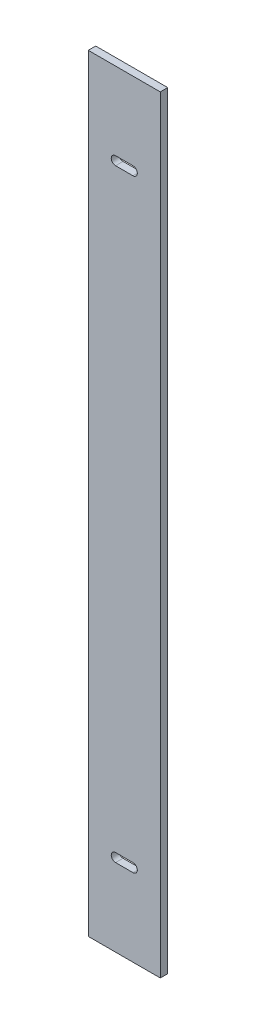
ISO-10303-21;
HEADER;
FILE_DESCRIPTION(('STEP AP214'),'2;1');
FILE_NAME('part.step','',(''),(''),'','','');
FILE_SCHEMA(('AUTOMOTIVE_DESIGN { 1 0 10303 214 1 1 1 1 }'));
ENDSEC;
DATA;
#1=APPLICATION_CONTEXT('core data for automotive mechanical design processes');
#2=APPLICATION_PROTOCOL_DEFINITION('international standard','automotive_design',2000,#1);
#3=PRODUCT_CONTEXT('',#1,'mechanical');
#4=PRODUCT('Part','Part','',(#3));
#5=PRODUCT_RELATED_PRODUCT_CATEGORY('part','',(#4));
#6=PRODUCT_DEFINITION_FORMATION('','',#4);
#7=PRODUCT_DEFINITION_CONTEXT('part definition',#1,'design');
#8=PRODUCT_DEFINITION('design','',#6,#7);
#9=PRODUCT_DEFINITION_SHAPE('','',#8);
#10=(LENGTH_UNIT() NAMED_UNIT(*) SI_UNIT(.MILLI.,.METRE.));
#11=(NAMED_UNIT(*) PLANE_ANGLE_UNIT() SI_UNIT($,.RADIAN.));
#12=(NAMED_UNIT(*) SI_UNIT($,.STERADIAN.) SOLID_ANGLE_UNIT());
#13=UNCERTAINTY_MEASURE_WITH_UNIT(LENGTH_MEASURE(1.E-05),#10,'distance_accuracy_value','');
#14=(GEOMETRIC_REPRESENTATION_CONTEXT(3) GLOBAL_UNCERTAINTY_ASSIGNED_CONTEXT((#13)) GLOBAL_UNIT_ASSIGNED_CONTEXT((#10,
#11,#12)) REPRESENTATION_CONTEXT('',''));
#15=CARTESIAN_POINT('',(0.,0.,0.));
#16=DIRECTION('',(0.,0.,1.));
#17=DIRECTION('',(1.,0.,0.));
#18=AXIS2_PLACEMENT_3D('',#15,#16,#17);
#19=CARTESIAN_POINT('',(0.,0.,3.));
#20=DIRECTION('',(0.,0.,-1.));
#21=DIRECTION('',(-1.,0.,0.));
#22=AXIS2_PLACEMENT_3D('',#19,#20,#21);
#23=PLANE('',#22);
#24=CARTESIAN_POINT('',(-3.5,121.5,3.));
#25=DIRECTION('',(0.,0.,1.));
#26=DIRECTION('',(1.,0.,0.));
#27=AXIS2_PLACEMENT_3D('',#24,#25,#26);
#28=CIRCLE('',#27,1.75);
#29=CARTESIAN_POINT('',(-3.5,123.25,3.));
#30=VERTEX_POINT('',#29);
#31=CARTESIAN_POINT('',(-3.5,119.75,3.));
#32=VERTEX_POINT('',#31);
#33=EDGE_CURVE('E167',#30,#32,#28,.T.);
#34=ORIENTED_EDGE('',*,*,#33,.F.);
#35=DIRECTION('',(-1.,0.,0.));
#36=VECTOR('',#35,1.);
#37=CARTESIAN_POINT('',(-3.5,123.25,3.));
#38=LINE('',#37,#36);
#39=CARTESIAN_POINT('',(3.5,123.25,3.));
#40=VERTEX_POINT('',#39);
#41=EDGE_CURVE('E175',#40,#30,#38,.T.);
#42=ORIENTED_EDGE('',*,*,#41,.F.);
#43=CARTESIAN_POINT('',(3.5,121.5,3.));
#44=DIRECTION('',(0.,0.,1.));
#45=DIRECTION('',(1.,0.,0.));
#46=AXIS2_PLACEMENT_3D('',#43,#44,#45);
#47=CIRCLE('',#46,1.75);
#48=CARTESIAN_POINT('',(3.5,119.75,3.));
#49=VERTEX_POINT('',#48);
#50=EDGE_CURVE('E172',#49,#40,#47,.T.);
#51=ORIENTED_EDGE('',*,*,#50,.F.);
#52=DIRECTION('',(1.,0.,0.));
#53=VECTOR('',#52,1.);
#54=CARTESIAN_POINT('',(-3.5,119.75,3.));
#55=LINE('',#54,#53);
#56=EDGE_CURVE('E169',#32,#49,#55,.T.);
#57=ORIENTED_EDGE('',*,*,#56,.F.);
#58=EDGE_LOOP('',(#34,#42,#51,#57));
#59=FACE_BOUND('',#58,.T.);
#60=DIRECTION('',(0.,-1.,0.));
#61=VECTOR('',#60,1.);
#62=CARTESIAN_POINT('',(-14.5,154.5,3.));
#63=LINE('',#62,#61);
#64=CARTESIAN_POINT('',(-14.5,154.5,3.));
#65=VERTEX_POINT('',#64);
#66=CARTESIAN_POINT('',(-14.5,-154.5,3.));
#67=VERTEX_POINT('',#66);
#68=EDGE_CURVE('E198',#65,#67,#63,.T.);
#69=ORIENTED_EDGE('',*,*,#68,.T.);
#70=DIRECTION('',(1.,0.,0.));
#71=VECTOR('',#70,1.);
#72=CARTESIAN_POINT('',(14.5,-154.5,3.));
#73=LINE('',#72,#71);
#74=CARTESIAN_POINT('',(14.5,-154.5,3.));
#75=VERTEX_POINT('',#74);
#76=EDGE_CURVE('E201',#67,#75,#73,.T.);
#77=ORIENTED_EDGE('',*,*,#76,.T.);
#78=DIRECTION('',(0.,1.,0.));
#79=VECTOR('',#78,1.);
#80=CARTESIAN_POINT('',(14.5,154.5,3.));
#81=LINE('',#80,#79);
#82=CARTESIAN_POINT('',(14.5,154.5,3.));
#83=VERTEX_POINT('',#82);
#84=EDGE_CURVE('E204',#75,#83,#81,.T.);
#85=ORIENTED_EDGE('',*,*,#84,.T.);
#86=DIRECTION('',(-1.,0.,0.));
#87=VECTOR('',#86,1.);
#88=CARTESIAN_POINT('',(14.5,154.5,3.));
#89=LINE('',#88,#87);
#90=EDGE_CURVE('E206',#83,#65,#89,.T.);
#91=ORIENTED_EDGE('',*,*,#90,.T.);
#92=EDGE_LOOP('',(#69,#77,#85,#91));
#93=FACE_BOUND('',#92,.T.);
#94=CARTESIAN_POINT('',(-3.5,-121.5,3.));
#95=DIRECTION('',(0.,0.,1.));
#96=DIRECTION('',(-1.,0.,0.));
#97=AXIS2_PLACEMENT_3D('',#94,#95,#96);
#98=CIRCLE('',#97,1.75);
#99=CARTESIAN_POINT('',(-3.5,-119.75,3.));
#100=VERTEX_POINT('',#99);
#101=CARTESIAN_POINT('',(-3.5,-123.25,3.));
#102=VERTEX_POINT('',#101);
#103=EDGE_CURVE('E131',#100,#102,#98,.T.);
#104=ORIENTED_EDGE('',*,*,#103,.F.);
#105=DIRECTION('',(-1.,0.,0.));
#106=VECTOR('',#105,1.);
#107=CARTESIAN_POINT('',(-3.5,-119.75,3.));
#108=LINE('',#107,#106);
#109=CARTESIAN_POINT('',(3.5,-119.75,3.));
#110=VERTEX_POINT('',#109);
#111=EDGE_CURVE('E153',#110,#100,#108,.T.);
#112=ORIENTED_EDGE('',*,*,#111,.F.);
#113=CARTESIAN_POINT('',(3.5,-121.5,3.));
#114=DIRECTION('',(0.,0.,1.));
#115=DIRECTION('',(-1.,0.,0.));
#116=AXIS2_PLACEMENT_3D('',#113,#114,#115);
#117=CIRCLE('',#116,1.75);
#118=CARTESIAN_POINT('',(3.5,-123.25,3.));
#119=VERTEX_POINT('',#118);
#120=EDGE_CURVE('E151',#119,#110,#117,.T.);
#121=ORIENTED_EDGE('',*,*,#120,.F.);
#122=DIRECTION('',(1.,0.,0.));
#123=VECTOR('',#122,1.);
#124=CARTESIAN_POINT('',(-3.5,-123.25,3.));
#125=LINE('',#124,#123);
#126=EDGE_CURVE('E139',#102,#119,#125,.T.);
#127=ORIENTED_EDGE('',*,*,#126,.F.);
#128=EDGE_LOOP('',(#104,#112,#121,#127));
#129=FACE_BOUND('',#128,.T.);
#130=ADVANCED_FACE('F42',(#59,#93,#129),#23,.F.);
#131=CARTESIAN_POINT('',(0.,0.,0.));
#132=DIRECTION('',(0.,0.,-1.));
#133=DIRECTION('',(-1.,0.,0.));
#134=AXIS2_PLACEMENT_3D('',#131,#132,#133);
#135=PLANE('',#134);
#136=DIRECTION('',(0.,-1.,0.));
#137=VECTOR('',#136,1.);
#138=CARTESIAN_POINT('',(-14.5,154.5,0.));
#139=LINE('',#138,#137);
#140=CARTESIAN_POINT('',(-14.5,154.5,0.));
#141=VERTEX_POINT('',#140);
#142=CARTESIAN_POINT('',(-14.5,-154.5,0.));
#143=VERTEX_POINT('',#142);
#144=EDGE_CURVE('E197',#141,#143,#139,.T.);
#145=ORIENTED_EDGE('',*,*,#144,.F.);
#146=DIRECTION('',(-1.,0.,0.));
#147=VECTOR('',#146,1.);
#148=CARTESIAN_POINT('',(14.5,154.5,0.));
#149=LINE('',#148,#147);
#150=CARTESIAN_POINT('',(14.5,154.5,0.));
#151=VERTEX_POINT('',#150);
#152=EDGE_CURVE('E202',#151,#141,#149,.T.);
#153=ORIENTED_EDGE('',*,*,#152,.F.);
#154=DIRECTION('',(0.,1.,0.));
#155=VECTOR('',#154,1.);
#156=CARTESIAN_POINT('',(14.5,154.5,0.));
#157=LINE('',#156,#155);
#158=CARTESIAN_POINT('',(14.5,-154.5,0.));
#159=VERTEX_POINT('',#158);
#160=EDGE_CURVE('E213',#159,#151,#157,.T.);
#161=ORIENTED_EDGE('',*,*,#160,.F.);
#162=DIRECTION('',(1.,0.,0.));
#163=VECTOR('',#162,1.);
#164=CARTESIAN_POINT('',(14.5,-154.5,0.));
#165=LINE('',#164,#163);
#166=EDGE_CURVE('E211',#143,#159,#165,.T.);
#167=ORIENTED_EDGE('',*,*,#166,.F.);
#168=EDGE_LOOP('',(#145,#153,#161,#167));
#169=FACE_BOUND('',#168,.T.);
#170=DIRECTION('',(-1.,0.,0.));
#171=VECTOR('',#170,1.);
#172=CARTESIAN_POINT('',(-3.5,123.25,0.));
#173=LINE('',#172,#171);
#174=CARTESIAN_POINT('',(3.5,123.25,0.));
#175=VERTEX_POINT('',#174);
#176=CARTESIAN_POINT('',(-3.5,123.25,0.));
#177=VERTEX_POINT('',#176);
#178=EDGE_CURVE('E170',#175,#177,#173,.T.);
#179=ORIENTED_EDGE('',*,*,#178,.T.);
#180=CARTESIAN_POINT('',(-3.5,121.5,0.));
#181=DIRECTION('',(0.,0.,1.));
#182=DIRECTION('',(1.,0.,0.));
#183=AXIS2_PLACEMENT_3D('',#180,#181,#182);
#184=CIRCLE('',#183,1.75);
#185=CARTESIAN_POINT('',(-3.5,119.75,0.));
#186=VERTEX_POINT('',#185);
#187=EDGE_CURVE('E147',#177,#186,#184,.T.);
#188=ORIENTED_EDGE('',*,*,#187,.T.);
#189=DIRECTION('',(1.,0.,0.));
#190=VECTOR('',#189,1.);
#191=CARTESIAN_POINT('',(-3.5,119.75,0.));
#192=LINE('',#191,#190);
#193=CARTESIAN_POINT('',(3.5,119.75,0.));
#194=VERTEX_POINT('',#193);
#195=EDGE_CURVE('E180',#186,#194,#192,.T.);
#196=ORIENTED_EDGE('',*,*,#195,.T.);
#197=CARTESIAN_POINT('',(3.5,121.5,0.));
#198=DIRECTION('',(0.,0.,1.));
#199=DIRECTION('',(1.,0.,0.));
#200=AXIS2_PLACEMENT_3D('',#197,#198,#199);
#201=CIRCLE('',#200,1.75);
#202=EDGE_CURVE('E183',#194,#175,#201,.T.);
#203=ORIENTED_EDGE('',*,*,#202,.T.);
#204=EDGE_LOOP('',(#179,#188,#196,#203));
#205=FACE_BOUND('',#204,.T.);
#206=DIRECTION('',(-1.,0.,0.));
#207=VECTOR('',#206,1.);
#208=CARTESIAN_POINT('',(-3.5,-119.75,0.));
#209=LINE('',#208,#207);
#210=CARTESIAN_POINT('',(3.5,-119.75,0.));
#211=VERTEX_POINT('',#210);
#212=CARTESIAN_POINT('',(-3.5,-119.75,0.));
#213=VERTEX_POINT('',#212);
#214=EDGE_CURVE('E140',#211,#213,#209,.T.);
#215=ORIENTED_EDGE('',*,*,#214,.T.);
#216=CARTESIAN_POINT('',(-3.5,-121.5,0.));
#217=DIRECTION('',(0.,0.,1.));
#218=DIRECTION('',(-1.,0.,0.));
#219=AXIS2_PLACEMENT_3D('',#216,#217,#218);
#220=CIRCLE('',#219,1.75);
#221=CARTESIAN_POINT('',(-3.5,-123.25,0.));
#222=VERTEX_POINT('',#221);
#223=EDGE_CURVE('E65',#213,#222,#220,.T.);
#224=ORIENTED_EDGE('',*,*,#223,.T.);
#225=DIRECTION('',(1.,0.,0.));
#226=VECTOR('',#225,1.);
#227=CARTESIAN_POINT('',(-3.5,-123.25,0.));
#228=LINE('',#227,#226);
#229=CARTESIAN_POINT('',(3.5,-123.25,0.));
#230=VERTEX_POINT('',#229);
#231=EDGE_CURVE('E146',#222,#230,#228,.T.);
#232=ORIENTED_EDGE('',*,*,#231,.T.);
#233=CARTESIAN_POINT('',(3.5,-121.5,0.));
#234=DIRECTION('',(0.,0.,1.));
#235=DIRECTION('',(-1.,0.,0.));
#236=AXIS2_PLACEMENT_3D('',#233,#234,#235);
#237=CIRCLE('',#236,1.75);
#238=EDGE_CURVE('E159',#230,#211,#237,.T.);
#239=ORIENTED_EDGE('',*,*,#238,.T.);
#240=EDGE_LOOP('',(#215,#224,#232,#239));
#241=FACE_BOUND('',#240,.T.);
#242=ADVANCED_FACE('F231',(#169,#205,#241),#135,.T.);
#243=CARTESIAN_POINT('',(-14.5,154.5,3.));
#244=DIRECTION('',(1.,0.,0.));
#245=DIRECTION('',(0.,0.,-1.));
#246=AXIS2_PLACEMENT_3D('',#243,#244,#245);
#247=PLANE('',#246);
#248=ORIENTED_EDGE('',*,*,#144,.T.);
#249=DIRECTION('',(0.,0.,-1.));
#250=VECTOR('',#249,1.);
#251=CARTESIAN_POINT('',(-14.5,-154.5,3.));
#252=LINE('',#251,#250);
#253=EDGE_CURVE('E11',#67,#143,#252,.T.);
#254=ORIENTED_EDGE('',*,*,#253,.F.);
#255=ORIENTED_EDGE('',*,*,#68,.F.);
#256=DIRECTION('',(0.,0.,-1.));
#257=VECTOR('',#256,1.);
#258=CARTESIAN_POINT('',(-14.5,154.5,3.));
#259=LINE('',#258,#257);
#260=EDGE_CURVE('E208',#65,#141,#259,.T.);
#261=ORIENTED_EDGE('',*,*,#260,.T.);
#262=EDGE_LOOP('',(#248,#254,#255,#261));
#263=FACE_BOUND('',#262,.T.);
#264=ADVANCED_FACE('F44',(#263),#247,.F.);
#265=CARTESIAN_POINT('',(14.5,-154.5,3.));
#266=DIRECTION('',(0.,1.,0.));
#267=DIRECTION('',(0.,0.,1.));
#268=AXIS2_PLACEMENT_3D('',#265,#266,#267);
#269=PLANE('',#268);
#270=ORIENTED_EDGE('',*,*,#166,.T.);
#271=DIRECTION('',(0.,0.,-1.));
#272=VECTOR('',#271,1.);
#273=CARTESIAN_POINT('',(14.5,-154.5,3.));
#274=LINE('',#273,#272);
#275=EDGE_CURVE('E50',#75,#159,#274,.T.);
#276=ORIENTED_EDGE('',*,*,#275,.F.);
#277=ORIENTED_EDGE('',*,*,#76,.F.);
#278=ORIENTED_EDGE('',*,*,#253,.T.);
#279=EDGE_LOOP('',(#270,#276,#277,#278));
#280=FACE_BOUND('',#279,.T.);
#281=ADVANCED_FACE('F241',(#280),#269,.F.);
#282=CARTESIAN_POINT('',(14.5,154.5,3.));
#283=DIRECTION('',(-1.,0.,0.));
#284=DIRECTION('',(0.,0.,1.));
#285=AXIS2_PLACEMENT_3D('',#282,#283,#284);
#286=PLANE('',#285);
#287=ORIENTED_EDGE('',*,*,#160,.T.);
#288=DIRECTION('',(0.,0.,-1.));
#289=VECTOR('',#288,1.);
#290=CARTESIAN_POINT('',(14.5,154.5,3.));
#291=LINE('',#290,#289);
#292=EDGE_CURVE('E218',#83,#151,#291,.T.);
#293=ORIENTED_EDGE('',*,*,#292,.F.);
#294=ORIENTED_EDGE('',*,*,#84,.F.);
#295=ORIENTED_EDGE('',*,*,#275,.T.);
#296=EDGE_LOOP('',(#287,#293,#294,#295));
#297=FACE_BOUND('',#296,.T.);
#298=ADVANCED_FACE('F225',(#297),#286,.F.);
#299=CARTESIAN_POINT('',(14.5,154.5,3.));
#300=DIRECTION('',(0.,-1.,0.));
#301=DIRECTION('',(0.,0.,-1.));
#302=AXIS2_PLACEMENT_3D('',#299,#300,#301);
#303=PLANE('',#302);
#304=ORIENTED_EDGE('',*,*,#152,.T.);
#305=ORIENTED_EDGE('',*,*,#260,.F.);
#306=ORIENTED_EDGE('',*,*,#90,.F.);
#307=ORIENTED_EDGE('',*,*,#292,.T.);
#308=EDGE_LOOP('',(#304,#305,#306,#307));
#309=FACE_BOUND('',#308,.T.);
#310=ADVANCED_FACE('F235',(#309),#303,.F.);
#311=CARTESIAN_POINT('',(-3.5,121.5,3.));
#312=DIRECTION('',(0.,0.,-1.));
#313=DIRECTION('',(-1.,0.,0.));
#314=AXIS2_PLACEMENT_3D('',#311,#312,#313);
#315=CYLINDRICAL_SURFACE('',#314,1.75);
#316=ORIENTED_EDGE('',*,*,#187,.F.);
#317=DIRECTION('',(0.,0.,-1.));
#318=VECTOR('',#317,1.);
#319=CARTESIAN_POINT('',(-3.5,123.25,3.));
#320=LINE('',#319,#318);
#321=EDGE_CURVE('E177',#30,#177,#320,.T.);
#322=ORIENTED_EDGE('',*,*,#321,.F.);
#323=ORIENTED_EDGE('',*,*,#33,.T.);
#324=DIRECTION('',(0.,0.,-1.));
#325=VECTOR('',#324,1.);
#326=CARTESIAN_POINT('',(-3.5,119.75,3.));
#327=LINE('',#326,#325);
#328=EDGE_CURVE('E194',#32,#186,#327,.T.);
#329=ORIENTED_EDGE('',*,*,#328,.T.);
#330=EDGE_LOOP('',(#316,#322,#323,#329));
#331=FACE_BOUND('',#330,.T.);
#332=ADVANCED_FACE('F257',(#331),#315,.F.);
#333=CARTESIAN_POINT('',(-3.5,119.75,3.));
#334=DIRECTION('',(0.,1.,0.));
#335=DIRECTION('',(0.,0.,1.));
#336=AXIS2_PLACEMENT_3D('',#333,#334,#335);
#337=PLANE('',#336);
#338=ORIENTED_EDGE('',*,*,#195,.F.);
#339=ORIENTED_EDGE('',*,*,#328,.F.);
#340=ORIENTED_EDGE('',*,*,#56,.T.);
#341=DIRECTION('',(0.,0.,-1.));
#342=VECTOR('',#341,1.);
#343=CARTESIAN_POINT('',(3.5,119.75,3.));
#344=LINE('',#343,#342);
#345=EDGE_CURVE('E192',#49,#194,#344,.T.);
#346=ORIENTED_EDGE('',*,*,#345,.T.);
#347=EDGE_LOOP('',(#338,#339,#340,#346));
#348=FACE_BOUND('',#347,.T.);
#349=ADVANCED_FACE('F264',(#348),#337,.T.);
#350=CARTESIAN_POINT('',(3.5,121.5,3.));
#351=DIRECTION('',(0.,0.,-1.));
#352=DIRECTION('',(-1.,0.,0.));
#353=AXIS2_PLACEMENT_3D('',#350,#351,#352);
#354=CYLINDRICAL_SURFACE('',#353,1.75);
#355=ORIENTED_EDGE('',*,*,#202,.F.);
#356=ORIENTED_EDGE('',*,*,#345,.F.);
#357=ORIENTED_EDGE('',*,*,#50,.T.);
#358=DIRECTION('',(0.,0.,-1.));
#359=VECTOR('',#358,1.);
#360=CARTESIAN_POINT('',(3.5,123.25,3.));
#361=LINE('',#360,#359);
#362=EDGE_CURVE('E190',#40,#175,#361,.T.);
#363=ORIENTED_EDGE('',*,*,#362,.T.);
#364=EDGE_LOOP('',(#355,#356,#357,#363));
#365=FACE_BOUND('',#364,.T.);
#366=ADVANCED_FACE('F269',(#365),#354,.F.);
#367=CARTESIAN_POINT('',(-3.5,123.25,3.));
#368=DIRECTION('',(0.,-1.,0.));
#369=DIRECTION('',(0.,0.,-1.));
#370=AXIS2_PLACEMENT_3D('',#367,#368,#369);
#371=PLANE('',#370);
#372=ORIENTED_EDGE('',*,*,#178,.F.);
#373=ORIENTED_EDGE('',*,*,#362,.F.);
#374=ORIENTED_EDGE('',*,*,#41,.T.);
#375=ORIENTED_EDGE('',*,*,#321,.T.);
#376=EDGE_LOOP('',(#372,#373,#374,#375));
#377=FACE_BOUND('',#376,.T.);
#378=ADVANCED_FACE('F275',(#377),#371,.T.);
#379=CARTESIAN_POINT('',(-3.5,-121.5,3.));
#380=DIRECTION('',(0.,0.,-1.));
#381=DIRECTION('',(-1.,0.,0.));
#382=AXIS2_PLACEMENT_3D('',#379,#380,#381);
#383=CYLINDRICAL_SURFACE('',#382,1.75);
#384=ORIENTED_EDGE('',*,*,#223,.F.);
#385=DIRECTION('',(0.,0.,-1.));
#386=VECTOR('',#385,1.);
#387=CARTESIAN_POINT('',(-3.5,-119.75,3.));
#388=LINE('',#387,#386);
#389=EDGE_CURVE('E135',#100,#213,#388,.T.);
#390=ORIENTED_EDGE('',*,*,#389,.F.);
#391=ORIENTED_EDGE('',*,*,#103,.T.);
#392=DIRECTION('',(0.,0.,-1.));
#393=VECTOR('',#392,1.);
#394=CARTESIAN_POINT('',(-3.5,-123.25,3.));
#395=LINE('',#394,#393);
#396=EDGE_CURVE('E134',#102,#222,#395,.T.);
#397=ORIENTED_EDGE('',*,*,#396,.T.);
#398=EDGE_LOOP('',(#384,#390,#391,#397));
#399=FACE_BOUND('',#398,.T.);
#400=ADVANCED_FACE('F133',(#399),#383,.F.);
#401=CARTESIAN_POINT('',(-3.5,-123.25,3.));
#402=DIRECTION('',(0.,1.,0.));
#403=DIRECTION('',(0.,0.,1.));
#404=AXIS2_PLACEMENT_3D('',#401,#402,#403);
#405=PLANE('',#404);
#406=ORIENTED_EDGE('',*,*,#231,.F.);
#407=ORIENTED_EDGE('',*,*,#396,.F.);
#408=ORIENTED_EDGE('',*,*,#126,.T.);
#409=DIRECTION('',(0.,0.,-1.));
#410=VECTOR('',#409,1.);
#411=CARTESIAN_POINT('',(3.5,-123.25,3.));
#412=LINE('',#411,#410);
#413=EDGE_CURVE('E148',#119,#230,#412,.T.);
#414=ORIENTED_EDGE('',*,*,#413,.T.);
#415=EDGE_LOOP('',(#406,#407,#408,#414));
#416=FACE_BOUND('',#415,.T.);
#417=ADVANCED_FACE('F143',(#416),#405,.T.);
#418=CARTESIAN_POINT('',(3.5,-121.5,3.));
#419=DIRECTION('',(0.,0.,-1.));
#420=DIRECTION('',(-1.,0.,0.));
#421=AXIS2_PLACEMENT_3D('',#418,#419,#420);
#422=CYLINDRICAL_SURFACE('',#421,1.75);
#423=ORIENTED_EDGE('',*,*,#238,.F.);
#424=ORIENTED_EDGE('',*,*,#413,.F.);
#425=ORIENTED_EDGE('',*,*,#120,.T.);
#426=DIRECTION('',(0.,0.,-1.));
#427=VECTOR('',#426,1.);
#428=CARTESIAN_POINT('',(3.5,-119.75,3.));
#429=LINE('',#428,#427);
#430=EDGE_CURVE('E57',#110,#211,#429,.T.);
#431=ORIENTED_EDGE('',*,*,#430,.T.);
#432=EDGE_LOOP('',(#423,#424,#425,#431));
#433=FACE_BOUND('',#432,.T.);
#434=ADVANCED_FACE('F294',(#433),#422,.F.);
#435=CARTESIAN_POINT('',(-3.5,-119.75,3.));
#436=DIRECTION('',(0.,-1.,0.));
#437=DIRECTION('',(0.,0.,-1.));
#438=AXIS2_PLACEMENT_3D('',#435,#436,#437);
#439=PLANE('',#438);
#440=ORIENTED_EDGE('',*,*,#214,.F.);
#441=ORIENTED_EDGE('',*,*,#430,.F.);
#442=ORIENTED_EDGE('',*,*,#111,.T.);
#443=ORIENTED_EDGE('',*,*,#389,.T.);
#444=EDGE_LOOP('',(#440,#441,#442,#443));
#445=FACE_BOUND('',#444,.T.);
#446=ADVANCED_FACE('F297',(#445),#439,.T.);
#447=CLOSED_SHELL('',(#130,#242,#264,#281,#298,#310,#332,#349,#366,#378,#400,#417,#434,#446));
#448=MANIFOLD_SOLID_BREP('B2',#447);
#449=ADVANCED_BREP_SHAPE_REPRESENTATION('',(#18,#448),#14);
#450=SHAPE_DEFINITION_REPRESENTATION(#9,#449);
ENDSEC;
END-ISO-10303-21;
